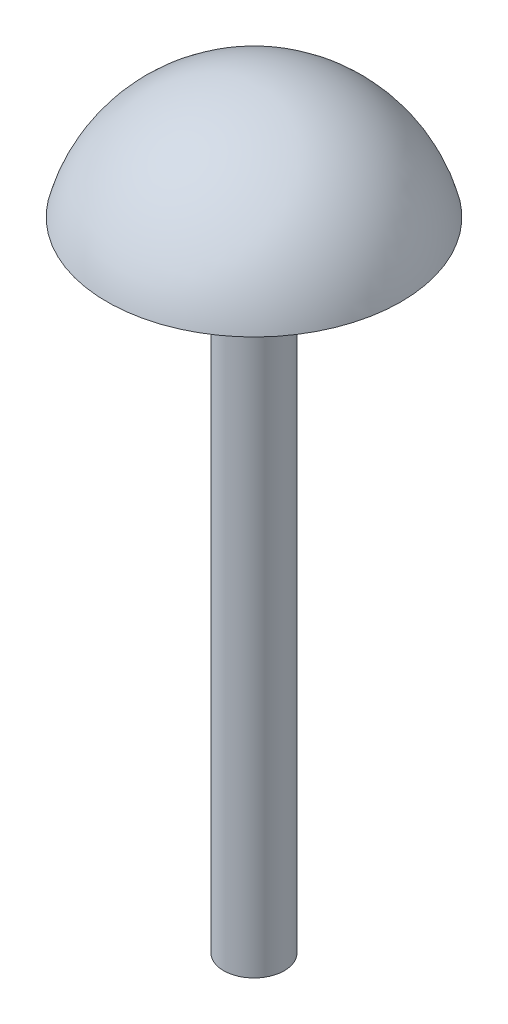
ISO-10303-21;
HEADER;
FILE_DESCRIPTION(('STEP AP214'),'2;1');
FILE_NAME('part.step','',(''),(''),'','','');
FILE_SCHEMA(('AUTOMOTIVE_DESIGN { 1 0 10303 214 1 1 1 1 }'));
ENDSEC;
DATA;
#1=APPLICATION_CONTEXT('core data for automotive mechanical design processes');
#2=APPLICATION_PROTOCOL_DEFINITION('international standard','automotive_design',2000,#1);
#3=PRODUCT_CONTEXT('',#1,'mechanical');
#4=PRODUCT('Part','Part','',(#3));
#5=PRODUCT_RELATED_PRODUCT_CATEGORY('part','',(#4));
#6=PRODUCT_DEFINITION_FORMATION('','',#4);
#7=PRODUCT_DEFINITION_CONTEXT('part definition',#1,'design');
#8=PRODUCT_DEFINITION('design','',#6,#7);
#9=PRODUCT_DEFINITION_SHAPE('','',#8);
#10=(LENGTH_UNIT() NAMED_UNIT(*) SI_UNIT(.MILLI.,.METRE.));
#11=(NAMED_UNIT(*) PLANE_ANGLE_UNIT() SI_UNIT($,.RADIAN.));
#12=(NAMED_UNIT(*) SI_UNIT($,.STERADIAN.) SOLID_ANGLE_UNIT());
#13=UNCERTAINTY_MEASURE_WITH_UNIT(LENGTH_MEASURE(1.E-05),#10,'distance_accuracy_value','');
#14=(GEOMETRIC_REPRESENTATION_CONTEXT(3) GLOBAL_UNCERTAINTY_ASSIGNED_CONTEXT((#13)) GLOBAL_UNIT_ASSIGNED_CONTEXT((#10,
#11,#12)) REPRESENTATION_CONTEXT('',''));
#15=CARTESIAN_POINT('',(0.,0.,0.));
#16=DIRECTION('',(0.,0.,1.));
#17=DIRECTION('',(1.,0.,0.));
#18=AXIS2_PLACEMENT_3D('',#15,#16,#17);
#19=CARTESIAN_POINT('',(0.,11.9854221546111,0.));
#20=DIRECTION('',(0.,-1.,0.));
#21=DIRECTION('',(1.,0.,0.));
#22=AXIS2_PLACEMENT_3D('',#19,#20,#21);
#23=SPHERICAL_SURFACE('',#22,3.03262366459841);
#24=CARTESIAN_POINT('',(0.,12.7396391260924,0.));
#25=DIRECTION('',(0.,-1.,0.));
#26=DIRECTION('',(0.,0.,-1.));
#27=AXIS2_PLACEMENT_3D('',#24,#25,#26);
#28=CIRCLE('',#27,2.93733945110398);
#29=CARTESIAN_POINT('',(0.,12.7396391260924,-2.93733945110398));
#30=VERTEX_POINT('',#29);
#31=EDGE_CURVE('E10',#30,#30,#28,.T.);
#32=ORIENTED_EDGE('',*,*,#31,.F.);
#33=EDGE_LOOP('',(#32));
#34=FACE_BOUND('',#33,.T.);
#35=ADVANCED_FACE('F32',(#34),#23,.T.);
#36=CARTESIAN_POINT('',(0.608019319776627,12.7396391260924,0.));
#37=DIRECTION('',(0.,-1.,0.));
#38=DIRECTION('',(0.,0.,-1.));
#39=AXIS2_PLACEMENT_3D('',#36,#37,#38);
#40=PLANE('',#39);
#41=ORIENTED_EDGE('',*,*,#31,.T.);
#42=EDGE_LOOP('',(#41));
#43=FACE_BOUND('',#42,.T.);
#44=CARTESIAN_POINT('',(0.,12.7396391260924,0.));
#45=DIRECTION('',(0.,-1.,0.));
#46=DIRECTION('',(0.,0.,-1.));
#47=AXIS2_PLACEMENT_3D('',#44,#45,#46);
#48=CIRCLE('',#47,0.608019319776627);
#49=CARTESIAN_POINT('',(0.,12.7396391260924,-0.608019319776627));
#50=VERTEX_POINT('',#49);
#51=EDGE_CURVE('E38',#50,#50,#48,.T.);
#52=ORIENTED_EDGE('',*,*,#51,.F.);
#53=EDGE_LOOP('',(#52));
#54=FACE_BOUND('',#53,.T.);
#55=ADVANCED_FACE('F53',(#43,#54),#40,.T.);
#56=CARTESIAN_POINT('',(0.,0.,0.));
#57=DIRECTION('',(0.,-1.,0.));
#58=DIRECTION('',(0.,0.,-1.));
#59=AXIS2_PLACEMENT_3D('',#56,#57,#58);
#60=CYLINDRICAL_SURFACE('',#59,0.608019319776627);
#61=ORIENTED_EDGE('',*,*,#51,.T.);
#62=EDGE_LOOP('',(#61));
#63=FACE_BOUND('',#62,.T.);
#64=CARTESIAN_POINT('',(0.,0.,0.));
#65=DIRECTION('',(0.,-1.,0.));
#66=DIRECTION('',(0.,0.,-1.));
#67=AXIS2_PLACEMENT_3D('',#64,#65,#66);
#68=CIRCLE('',#67,0.608019319776627);
#69=CARTESIAN_POINT('',(0.,0.,-0.608019319776627));
#70=VERTEX_POINT('',#69);
#71=EDGE_CURVE('E42',#70,#70,#68,.T.);
#72=ORIENTED_EDGE('',*,*,#71,.F.);
#73=EDGE_LOOP('',(#72));
#74=FACE_BOUND('',#73,.T.);
#75=ADVANCED_FACE('F51',(#63,#74),#60,.T.);
#76=CARTESIAN_POINT('',(0.,0.,0.));
#77=DIRECTION('',(0.,-1.,0.));
#78=DIRECTION('',(0.,0.,-1.));
#79=AXIS2_PLACEMENT_3D('',#76,#77,#78);
#80=PLANE('',#79);
#81=ORIENTED_EDGE('',*,*,#71,.T.);
#82=EDGE_LOOP('',(#81));
#83=FACE_BOUND('',#82,.T.);
#84=ADVANCED_FACE('F49',(#83),#80,.T.);
#85=CLOSED_SHELL('',(#35,#55,#75,#84));
#86=MANIFOLD_SOLID_BREP('B2',#85);
#87=ADVANCED_BREP_SHAPE_REPRESENTATION('',(#18,#86),#14);
#88=SHAPE_DEFINITION_REPRESENTATION(#9,#87);
ENDSEC;
END-ISO-10303-21;
